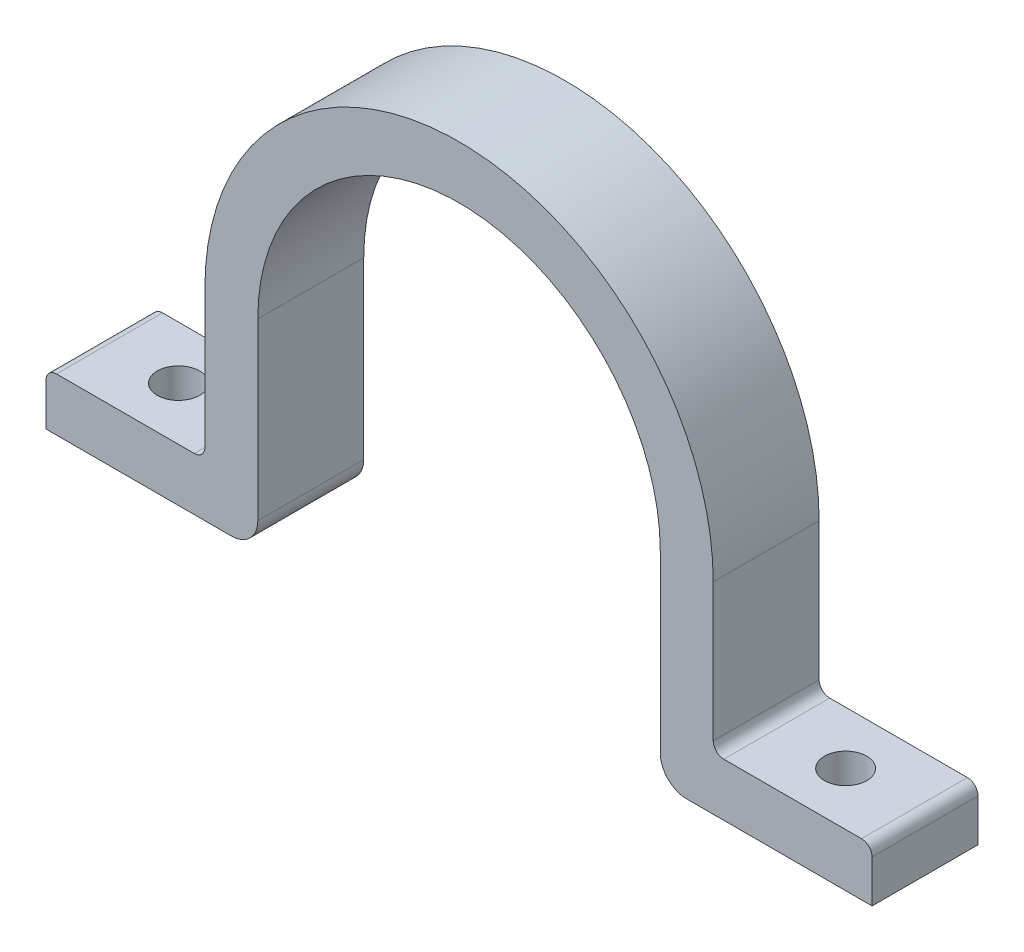
ISO-10303-21;
HEADER;
FILE_DESCRIPTION(('STEP AP214'),'2;1');
FILE_NAME('part.step','',(''),(''),'','','');
FILE_SCHEMA(('AUTOMOTIVE_DESIGN { 1 0 10303 214 1 1 1 1 }'));
ENDSEC;
DATA;
#1=APPLICATION_CONTEXT('core data for automotive mechanical design processes');
#2=APPLICATION_PROTOCOL_DEFINITION('international standard','automotive_design',2000,#1);
#3=PRODUCT_CONTEXT('',#1,'mechanical');
#4=PRODUCT('Part','Part','',(#3));
#5=PRODUCT_RELATED_PRODUCT_CATEGORY('part','',(#4));
#6=PRODUCT_DEFINITION_FORMATION('','',#4);
#7=PRODUCT_DEFINITION_CONTEXT('part definition',#1,'design');
#8=PRODUCT_DEFINITION('design','',#6,#7);
#9=PRODUCT_DEFINITION_SHAPE('','',#8);
#10=(LENGTH_UNIT() NAMED_UNIT(*) SI_UNIT(.MILLI.,.METRE.));
#11=(NAMED_UNIT(*) PLANE_ANGLE_UNIT() SI_UNIT($,.RADIAN.));
#12=(NAMED_UNIT(*) SI_UNIT($,.STERADIAN.) SOLID_ANGLE_UNIT());
#13=UNCERTAINTY_MEASURE_WITH_UNIT(LENGTH_MEASURE(1.E-05),#10,'distance_accuracy_value','');
#14=(GEOMETRIC_REPRESENTATION_CONTEXT(3) GLOBAL_UNCERTAINTY_ASSIGNED_CONTEXT((#13)) GLOBAL_UNIT_ASSIGNED_CONTEXT((#10,
#11,#12)) REPRESENTATION_CONTEXT('',''));
#15=CARTESIAN_POINT('',(0.,0.,0.));
#16=DIRECTION('',(0.,0.,1.));
#17=DIRECTION('',(1.,0.,0.));
#18=AXIS2_PLACEMENT_3D('',#15,#16,#17);
#19=CARTESIAN_POINT('',(-48.,0.,20.));
#20=DIRECTION('',(1.,0.,0.));
#21=DIRECTION('',(0.,0.,-1.));
#22=AXIS2_PLACEMENT_3D('',#19,#20,#21);
#23=PLANE('',#22);
#24=DIRECTION('',(0.,-1.,0.));
#25=VECTOR('',#24,1.);
#26=CARTESIAN_POINT('',(-48.,0.,0.));
#27=LINE('',#26,#25);
#28=CARTESIAN_POINT('',(-48.,0.,0.));
#29=VERTEX_POINT('',#28);
#30=CARTESIAN_POINT('',(-48.,-26.,0.));
#31=VERTEX_POINT('',#30);
#32=EDGE_CURVE('E211',#29,#31,#27,.T.);
#33=ORIENTED_EDGE('',*,*,#32,.T.);
#34=DIRECTION('',(0.,0.,-1.));
#35=VECTOR('',#34,1.);
#36=CARTESIAN_POINT('',(-48.,-26.,20.));
#37=LINE('',#36,#35);
#38=CARTESIAN_POINT('',(-48.,-26.,20.));
#39=VERTEX_POINT('',#38);
#40=EDGE_CURVE('E280',#31,#39,#37,.F.);
#41=ORIENTED_EDGE('',*,*,#40,.T.);
#42=DIRECTION('',(0.,-1.,0.));
#43=VECTOR('',#42,1.);
#44=CARTESIAN_POINT('',(-48.,0.,20.));
#45=LINE('',#44,#43);
#46=CARTESIAN_POINT('',(-48.,0.,20.));
#47=VERTEX_POINT('',#46);
#48=EDGE_CURVE('E240',#47,#39,#45,.T.);
#49=ORIENTED_EDGE('',*,*,#48,.F.);
#50=DIRECTION('',(0.,0.,-1.));
#51=VECTOR('',#50,1.);
#52=CARTESIAN_POINT('',(-48.,0.,20.));
#53=LINE('',#52,#51);
#54=EDGE_CURVE('E210',#47,#29,#53,.T.);
#55=ORIENTED_EDGE('',*,*,#54,.T.);
#56=EDGE_LOOP('',(#33,#41,#49,#55));
#57=FACE_BOUND('',#56,.T.);
#58=ADVANCED_FACE('F43',(#57),#23,.F.);
#59=CARTESIAN_POINT('',(-48.,-28.,20.));
#60=DIRECTION('',(0.,-1.,0.));
#61=DIRECTION('',(1.,0.,0.));
#62=AXIS2_PLACEMENT_3D('',#59,#60,#61);
#63=PLANE('',#62);
#64=CARTESIAN_POINT('',(-63.,-28.,10.));
#65=DIRECTION('',(0.,1.,0.));
#66=DIRECTION('',(-1.,0.,0.));
#67=AXIS2_PLACEMENT_3D('',#64,#65,#66);
#68=CIRCLE('',#67,4.00000000000001);
#69=CARTESIAN_POINT('',(-67.,-28.,10.));
#70=VERTEX_POINT('',#69);
#71=EDGE_CURVE('E377',#70,#70,#68,.T.);
#72=ORIENTED_EDGE('',*,*,#71,.F.);
#73=EDGE_LOOP('',(#72));
#74=FACE_BOUND('',#73,.T.);
#75=DIRECTION('',(-1.,0.,0.));
#76=VECTOR('',#75,1.);
#77=CARTESIAN_POINT('',(-48.,-28.,0.));
#78=LINE('',#77,#76);
#79=CARTESIAN_POINT('',(-50.,-28.,0.));
#80=VERTEX_POINT('',#79);
#81=CARTESIAN_POINT('',(-76.,-28.,0.));
#82=VERTEX_POINT('',#81);
#83=EDGE_CURVE('E214',#80,#82,#78,.T.);
#84=ORIENTED_EDGE('',*,*,#83,.T.);
#85=DIRECTION('',(0.,0.,-1.));
#86=VECTOR('',#85,1.);
#87=CARTESIAN_POINT('',(-76.,-28.,20.));
#88=LINE('',#87,#86);
#89=CARTESIAN_POINT('',(-76.,-28.,20.));
#90=VERTEX_POINT('',#89);
#91=EDGE_CURVE('E278',#82,#90,#88,.F.);
#92=ORIENTED_EDGE('',*,*,#91,.T.);
#93=DIRECTION('',(-1.,0.,0.));
#94=VECTOR('',#93,1.);
#95=CARTESIAN_POINT('',(-48.,-28.,20.));
#96=LINE('',#95,#94);
#97=CARTESIAN_POINT('',(-50.,-28.,20.));
#98=VERTEX_POINT('',#97);
#99=EDGE_CURVE('E177',#98,#90,#96,.T.);
#100=ORIENTED_EDGE('',*,*,#99,.F.);
#101=DIRECTION('',(0.,0.,-1.));
#102=VECTOR('',#101,1.);
#103=CARTESIAN_POINT('',(-50.,-28.,0.));
#104=LINE('',#103,#102);
#105=EDGE_CURVE('E275',#98,#80,#104,.T.);
#106=ORIENTED_EDGE('',*,*,#105,.T.);
#107=EDGE_LOOP('',(#84,#92,#100,#106));
#108=FACE_BOUND('',#107,.T.);
#109=ADVANCED_FACE('F369',(#74,#108),#63,.F.);
#110=CARTESIAN_POINT('',(-78.,-28.,20.));
#111=DIRECTION('',(1.,0.,0.));
#112=DIRECTION('',(0.,0.,-1.));
#113=AXIS2_PLACEMENT_3D('',#110,#111,#112);
#114=PLANE('',#113);
#115=DIRECTION('',(0.,-1.,0.));
#116=VECTOR('',#115,1.);
#117=CARTESIAN_POINT('',(-78.,-28.,20.));
#118=LINE('',#117,#116);
#119=CARTESIAN_POINT('',(-78.,-30.,20.));
#120=VERTEX_POINT('',#119);
#121=CARTESIAN_POINT('',(-78.,-38.,20.));
#122=VERTEX_POINT('',#121);
#123=EDGE_CURVE('E166',#120,#122,#118,.T.);
#124=ORIENTED_EDGE('',*,*,#123,.F.);
#125=DIRECTION('',(0.,0.,-1.));
#126=VECTOR('',#125,1.);
#127=CARTESIAN_POINT('',(-78.,-30.,20.));
#128=LINE('',#127,#126);
#129=CARTESIAN_POINT('',(-78.,-30.,0.));
#130=VERTEX_POINT('',#129);
#131=EDGE_CURVE('E273',#120,#130,#128,.T.);
#132=ORIENTED_EDGE('',*,*,#131,.T.);
#133=DIRECTION('',(0.,-1.,0.));
#134=VECTOR('',#133,1.);
#135=CARTESIAN_POINT('',(-78.,-28.,0.));
#136=LINE('',#135,#134);
#137=CARTESIAN_POINT('',(-78.,-38.,0.));
#138=VERTEX_POINT('',#137);
#139=EDGE_CURVE('E183',#130,#138,#136,.T.);
#140=ORIENTED_EDGE('',*,*,#139,.T.);
#141=DIRECTION('',(0.,0.,-1.));
#142=VECTOR('',#141,1.);
#143=CARTESIAN_POINT('',(-78.,-38.,20.));
#144=LINE('',#143,#142);
#145=EDGE_CURVE('E180',#122,#138,#144,.T.);
#146=ORIENTED_EDGE('',*,*,#145,.F.);
#147=EDGE_LOOP('',(#124,#132,#140,#146));
#148=FACE_BOUND('',#147,.T.);
#149=ADVANCED_FACE('F181',(#148),#114,.F.);
#150=CARTESIAN_POINT('',(-38.,-38.,20.));
#151=DIRECTION('',(0.,1.,0.));
#152=DIRECTION('',(0.,0.,1.));
#153=AXIS2_PLACEMENT_3D('',#150,#151,#152);
#154=PLANE('',#153);
#155=CARTESIAN_POINT('',(-63.,-38.,10.));
#156=DIRECTION('',(0.,1.,0.));
#157=DIRECTION('',(0.,0.,1.));
#158=AXIS2_PLACEMENT_3D('',#155,#156,#157);
#159=CIRCLE('',#158,4.00000000000001);
#160=CARTESIAN_POINT('',(-63.,-38.,14.));
#161=VERTEX_POINT('',#160);
#162=EDGE_CURVE('E215',#161,#161,#159,.T.);
#163=ORIENTED_EDGE('',*,*,#162,.T.);
#164=EDGE_LOOP('',(#163));
#165=FACE_BOUND('',#164,.T.);
#166=DIRECTION('',(1.,0.,0.));
#167=VECTOR('',#166,1.);
#168=CARTESIAN_POINT('',(-38.,-38.,0.));
#169=LINE('',#168,#167);
#170=CARTESIAN_POINT('',(-43.,-38.,0.));
#171=VERTEX_POINT('',#170);
#172=EDGE_CURVE('E219',#138,#171,#169,.T.);
#173=ORIENTED_EDGE('',*,*,#172,.T.);
#174=DIRECTION('',(0.,0.,-1.));
#175=VECTOR('',#174,1.);
#176=CARTESIAN_POINT('',(-43.,-38.,20.));
#177=LINE('',#176,#175);
#178=CARTESIAN_POINT('',(-43.,-38.,20.));
#179=VERTEX_POINT('',#178);
#180=EDGE_CURVE('E11',#171,#179,#177,.F.);
#181=ORIENTED_EDGE('',*,*,#180,.T.);
#182=DIRECTION('',(1.,0.,0.));
#183=VECTOR('',#182,1.);
#184=CARTESIAN_POINT('',(-38.,-38.,20.));
#185=LINE('',#184,#183);
#186=EDGE_CURVE('E170',#122,#179,#185,.T.);
#187=ORIENTED_EDGE('',*,*,#186,.F.);
#188=ORIENTED_EDGE('',*,*,#145,.T.);
#189=EDGE_LOOP('',(#173,#181,#187,#188));
#190=FACE_BOUND('',#189,.T.);
#191=ADVANCED_FACE('F188',(#165,#190),#154,.F.);
#192=CARTESIAN_POINT('',(-38.,0.,20.));
#193=DIRECTION('',(-1.,0.,0.));
#194=DIRECTION('',(0.,-1.,0.));
#195=AXIS2_PLACEMENT_3D('',#192,#193,#194);
#196=PLANE('',#195);
#197=DIRECTION('',(0.,1.,0.));
#198=VECTOR('',#197,1.);
#199=CARTESIAN_POINT('',(-38.,0.,20.));
#200=LINE('',#199,#198);
#201=CARTESIAN_POINT('',(-38.,-33.,20.));
#202=VERTEX_POINT('',#201);
#203=CARTESIAN_POINT('',(-38.,0.,20.));
#204=VERTEX_POINT('',#203);
#205=EDGE_CURVE('E189',#202,#204,#200,.T.);
#206=ORIENTED_EDGE('',*,*,#205,.F.);
#207=DIRECTION('',(0.,0.,-1.));
#208=VECTOR('',#207,1.);
#209=CARTESIAN_POINT('',(-38.,-33.,20.));
#210=LINE('',#209,#208);
#211=CARTESIAN_POINT('',(-38.,-33.,0.));
#212=VERTEX_POINT('',#211);
#213=EDGE_CURVE('E51',#202,#212,#210,.T.);
#214=ORIENTED_EDGE('',*,*,#213,.T.);
#215=DIRECTION('',(0.,1.,0.));
#216=VECTOR('',#215,1.);
#217=CARTESIAN_POINT('',(-38.,0.,0.));
#218=LINE('',#217,#216);
#219=CARTESIAN_POINT('',(-38.,0.,0.));
#220=VERTEX_POINT('',#219);
#221=EDGE_CURVE('E221',#212,#220,#218,.T.);
#222=ORIENTED_EDGE('',*,*,#221,.T.);
#223=DIRECTION('',(0.,0.,-1.));
#224=VECTOR('',#223,1.);
#225=CARTESIAN_POINT('',(-38.,0.,20.));
#226=LINE('',#225,#224);
#227=EDGE_CURVE('E186',#204,#220,#226,.T.);
#228=ORIENTED_EDGE('',*,*,#227,.F.);
#229=EDGE_LOOP('',(#206,#214,#222,#228));
#230=FACE_BOUND('',#229,.T.);
#231=ADVANCED_FACE('F305',(#230),#196,.F.);
#232=CARTESIAN_POINT('',(0.,0.,20.));
#233=DIRECTION('',(0.,0.,-1.));
#234=DIRECTION('',(-1.,0.,0.));
#235=AXIS2_PLACEMENT_3D('',#232,#233,#234);
#236=CYLINDRICAL_SURFACE('',#235,38.);
#237=CARTESIAN_POINT('',(0.,0.,0.));
#238=DIRECTION('',(0.,0.,-1.));
#239=DIRECTION('',(-1.,0.,0.));
#240=AXIS2_PLACEMENT_3D('',#237,#238,#239);
#241=CIRCLE('',#240,38.);
#242=CARTESIAN_POINT('',(38.,0.,0.));
#243=VERTEX_POINT('',#242);
#244=EDGE_CURVE('E223',#220,#243,#241,.T.);
#245=ORIENTED_EDGE('',*,*,#244,.T.);
#246=DIRECTION('',(0.,0.,-1.));
#247=VECTOR('',#246,1.);
#248=CARTESIAN_POINT('',(38.,0.,20.));
#249=LINE('',#248,#247);
#250=CARTESIAN_POINT('',(38.,0.,20.));
#251=VERTEX_POINT('',#250);
#252=EDGE_CURVE('E249',#251,#243,#249,.T.);
#253=ORIENTED_EDGE('',*,*,#252,.F.);
#254=CARTESIAN_POINT('',(0.,0.,20.));
#255=DIRECTION('',(0.,0.,-1.));
#256=DIRECTION('',(-1.,0.,0.));
#257=AXIS2_PLACEMENT_3D('',#254,#255,#256);
#258=CIRCLE('',#257,38.);
#259=EDGE_CURVE('E191',#204,#251,#258,.T.);
#260=ORIENTED_EDGE('',*,*,#259,.F.);
#261=ORIENTED_EDGE('',*,*,#227,.T.);
#262=EDGE_LOOP('',(#245,#253,#260,#261));
#263=FACE_BOUND('',#262,.T.);
#264=ADVANCED_FACE('F315',(#263),#236,.F.);
#265=CARTESIAN_POINT('',(38.,0.,20.));
#266=DIRECTION('',(1.,0.,0.));
#267=DIRECTION('',(0.,1.,0.));
#268=AXIS2_PLACEMENT_3D('',#265,#266,#267);
#269=PLANE('',#268);
#270=DIRECTION('',(0.,-1.,0.));
#271=VECTOR('',#270,1.);
#272=CARTESIAN_POINT('',(38.,0.,0.));
#273=LINE('',#272,#271);
#274=CARTESIAN_POINT('',(38.,-33.,0.));
#275=VERTEX_POINT('',#274);
#276=EDGE_CURVE('E225',#243,#275,#273,.T.);
#277=ORIENTED_EDGE('',*,*,#276,.T.);
#278=DIRECTION('',(0.,0.,-1.));
#279=VECTOR('',#278,1.);
#280=CARTESIAN_POINT('',(38.,-33.,20.));
#281=LINE('',#280,#279);
#282=CARTESIAN_POINT('',(38.,-33.,20.));
#283=VERTEX_POINT('',#282);
#284=EDGE_CURVE('E297',#275,#283,#281,.F.);
#285=ORIENTED_EDGE('',*,*,#284,.T.);
#286=DIRECTION('',(0.,-1.,0.));
#287=VECTOR('',#286,1.);
#288=CARTESIAN_POINT('',(38.,0.,20.));
#289=LINE('',#288,#287);
#290=EDGE_CURVE('E196',#251,#283,#289,.T.);
#291=ORIENTED_EDGE('',*,*,#290,.F.);
#292=ORIENTED_EDGE('',*,*,#252,.T.);
#293=EDGE_LOOP('',(#277,#285,#291,#292));
#294=FACE_BOUND('',#293,.T.);
#295=ADVANCED_FACE('F319',(#294),#269,.F.);
#296=CARTESIAN_POINT('',(38.,-38.,20.));
#297=DIRECTION('',(0.,1.,0.));
#298=DIRECTION('',(0.,0.,1.));
#299=AXIS2_PLACEMENT_3D('',#296,#297,#298);
#300=PLANE('',#299);
#301=CARTESIAN_POINT('',(63.,-38.,10.));
#302=DIRECTION('',(0.,1.,0.));
#303=DIRECTION('',(0.,0.,1.));
#304=AXIS2_PLACEMENT_3D('',#301,#302,#303);
#305=CIRCLE('',#304,4.00000000000001);
#306=CARTESIAN_POINT('',(63.,-38.,14.));
#307=VERTEX_POINT('',#306);
#308=EDGE_CURVE('E256',#307,#307,#305,.T.);
#309=ORIENTED_EDGE('',*,*,#308,.T.);
#310=EDGE_LOOP('',(#309));
#311=FACE_BOUND('',#310,.T.);
#312=DIRECTION('',(1.,0.,0.));
#313=VECTOR('',#312,1.);
#314=CARTESIAN_POINT('',(38.,-38.,20.));
#315=LINE('',#314,#313);
#316=CARTESIAN_POINT('',(43.,-38.,20.));
#317=VERTEX_POINT('',#316);
#318=CARTESIAN_POINT('',(78.,-38.,20.));
#319=VERTEX_POINT('',#318);
#320=EDGE_CURVE('E198',#317,#319,#315,.T.);
#321=ORIENTED_EDGE('',*,*,#320,.F.);
#322=DIRECTION('',(0.,0.,-1.));
#323=VECTOR('',#322,1.);
#324=CARTESIAN_POINT('',(43.,-38.,20.));
#325=LINE('',#324,#323);
#326=CARTESIAN_POINT('',(43.,-38.,0.));
#327=VERTEX_POINT('',#326);
#328=EDGE_CURVE('E290',#317,#327,#325,.T.);
#329=ORIENTED_EDGE('',*,*,#328,.T.);
#330=DIRECTION('',(1.,0.,0.));
#331=VECTOR('',#330,1.);
#332=CARTESIAN_POINT('',(38.,-38.,0.));
#333=LINE('',#332,#331);
#334=CARTESIAN_POINT('',(78.,-38.,0.));
#335=VERTEX_POINT('',#334);
#336=EDGE_CURVE('E228',#327,#335,#333,.T.);
#337=ORIENTED_EDGE('',*,*,#336,.T.);
#338=DIRECTION('',(0.,0.,-1.));
#339=VECTOR('',#338,1.);
#340=CARTESIAN_POINT('',(78.,-38.,20.));
#341=LINE('',#340,#339);
#342=EDGE_CURVE('E246',#319,#335,#341,.T.);
#343=ORIENTED_EDGE('',*,*,#342,.F.);
#344=EDGE_LOOP('',(#321,#329,#337,#343));
#345=FACE_BOUND('',#344,.T.);
#346=ADVANCED_FACE('F327',(#311,#345),#300,.F.);
#347=CARTESIAN_POINT('',(78.,-28.,20.));
#348=DIRECTION('',(-1.,0.,0.));
#349=DIRECTION('',(0.,0.,1.));
#350=AXIS2_PLACEMENT_3D('',#347,#348,#349);
#351=PLANE('',#350);
#352=DIRECTION('',(0.,1.,0.));
#353=VECTOR('',#352,1.);
#354=CARTESIAN_POINT('',(78.,-28.,0.));
#355=LINE('',#354,#353);
#356=CARTESIAN_POINT('',(78.,-30.,0.));
#357=VERTEX_POINT('',#356);
#358=EDGE_CURVE('E230',#335,#357,#355,.T.);
#359=ORIENTED_EDGE('',*,*,#358,.T.);
#360=DIRECTION('',(0.,0.,-1.));
#361=VECTOR('',#360,1.);
#362=CARTESIAN_POINT('',(78.,-30.,20.));
#363=LINE('',#362,#361);
#364=CARTESIAN_POINT('',(78.,-30.,20.));
#365=VERTEX_POINT('',#364);
#366=EDGE_CURVE('E265',#357,#365,#363,.F.);
#367=ORIENTED_EDGE('',*,*,#366,.T.);
#368=DIRECTION('',(0.,1.,0.));
#369=VECTOR('',#368,1.);
#370=CARTESIAN_POINT('',(78.,-28.,20.));
#371=LINE('',#370,#369);
#372=EDGE_CURVE('E200',#319,#365,#371,.T.);
#373=ORIENTED_EDGE('',*,*,#372,.F.);
#374=ORIENTED_EDGE('',*,*,#342,.T.);
#375=EDGE_LOOP('',(#359,#367,#373,#374));
#376=FACE_BOUND('',#375,.T.);
#377=ADVANCED_FACE('F333',(#376),#351,.F.);
#378=CARTESIAN_POINT('',(48.,-28.,20.));
#379=DIRECTION('',(0.,-1.,0.));
#380=DIRECTION('',(1.,0.,0.));
#381=AXIS2_PLACEMENT_3D('',#378,#379,#380);
#382=PLANE('',#381);
#383=CARTESIAN_POINT('',(63.,-28.,10.));
#384=DIRECTION('',(0.,1.,0.));
#385=DIRECTION('',(-1.,0.,0.));
#386=AXIS2_PLACEMENT_3D('',#383,#384,#385);
#387=CIRCLE('',#386,4.00000000000001);
#388=CARTESIAN_POINT('',(59.,-28.,10.));
#389=VERTEX_POINT('',#388);
#390=EDGE_CURVE('E378',#389,#389,#387,.T.);
#391=ORIENTED_EDGE('',*,*,#390,.F.);
#392=EDGE_LOOP('',(#391));
#393=FACE_BOUND('',#392,.T.);
#394=DIRECTION('',(-1.,0.,0.));
#395=VECTOR('',#394,1.);
#396=CARTESIAN_POINT('',(48.,-28.,20.));
#397=LINE('',#396,#395);
#398=CARTESIAN_POINT('',(76.,-28.,20.));
#399=VERTEX_POINT('',#398);
#400=CARTESIAN_POINT('',(50.,-28.,20.));
#401=VERTEX_POINT('',#400);
#402=EDGE_CURVE('E203',#399,#401,#397,.T.);
#403=ORIENTED_EDGE('',*,*,#402,.F.);
#404=DIRECTION('',(0.,0.,-1.));
#405=VECTOR('',#404,1.);
#406=CARTESIAN_POINT('',(76.,-28.,20.));
#407=LINE('',#406,#405);
#408=CARTESIAN_POINT('',(76.,-28.,0.));
#409=VERTEX_POINT('',#408);
#410=EDGE_CURVE('E258',#399,#409,#407,.T.);
#411=ORIENTED_EDGE('',*,*,#410,.T.);
#412=DIRECTION('',(-1.,0.,0.));
#413=VECTOR('',#412,1.);
#414=CARTESIAN_POINT('',(48.,-28.,0.));
#415=LINE('',#414,#413);
#416=CARTESIAN_POINT('',(50.,-28.,0.));
#417=VERTEX_POINT('',#416);
#418=EDGE_CURVE('E233',#409,#417,#415,.T.);
#419=ORIENTED_EDGE('',*,*,#418,.T.);
#420=DIRECTION('',(0.,0.,-1.));
#421=VECTOR('',#420,1.);
#422=CARTESIAN_POINT('',(50.,-28.,20.));
#423=LINE('',#422,#421);
#424=EDGE_CURVE('E185',#417,#401,#423,.F.);
#425=ORIENTED_EDGE('',*,*,#424,.T.);
#426=EDGE_LOOP('',(#403,#411,#419,#425));
#427=FACE_BOUND('',#426,.T.);
#428=ADVANCED_FACE('F342',(#393,#427),#382,.F.);
#429=CARTESIAN_POINT('',(48.,0.,20.));
#430=DIRECTION('',(-1.,0.,0.));
#431=DIRECTION('',(0.,-1.,0.));
#432=AXIS2_PLACEMENT_3D('',#429,#430,#431);
#433=PLANE('',#432);
#434=DIRECTION('',(0.,1.,0.));
#435=VECTOR('',#434,1.);
#436=CARTESIAN_POINT('',(48.,0.,20.));
#437=LINE('',#436,#435);
#438=CARTESIAN_POINT('',(48.,-26.,20.));
#439=VERTEX_POINT('',#438);
#440=CARTESIAN_POINT('',(48.,0.,20.));
#441=VERTEX_POINT('',#440);
#442=EDGE_CURVE('E206',#439,#441,#437,.T.);
#443=ORIENTED_EDGE('',*,*,#442,.F.);
#444=DIRECTION('',(0.,0.,-1.));
#445=VECTOR('',#444,1.);
#446=CARTESIAN_POINT('',(48.,-26.,0.));
#447=LINE('',#446,#445);
#448=CARTESIAN_POINT('',(48.,-26.,0.));
#449=VERTEX_POINT('',#448);
#450=EDGE_CURVE('E270',#439,#449,#447,.T.);
#451=ORIENTED_EDGE('',*,*,#450,.T.);
#452=DIRECTION('',(0.,1.,0.));
#453=VECTOR('',#452,1.);
#454=CARTESIAN_POINT('',(48.,0.,0.));
#455=LINE('',#454,#453);
#456=CARTESIAN_POINT('',(48.,0.,0.));
#457=VERTEX_POINT('',#456);
#458=EDGE_CURVE('E236',#449,#457,#455,.T.);
#459=ORIENTED_EDGE('',*,*,#458,.T.);
#460=DIRECTION('',(0.,0.,-1.));
#461=VECTOR('',#460,1.);
#462=CARTESIAN_POINT('',(48.,0.,20.));
#463=LINE('',#462,#461);
#464=EDGE_CURVE('E243',#441,#457,#463,.T.);
#465=ORIENTED_EDGE('',*,*,#464,.F.);
#466=EDGE_LOOP('',(#443,#451,#459,#465));
#467=FACE_BOUND('',#466,.T.);
#468=ADVANCED_FACE('F350',(#467),#433,.F.);
#469=CARTESIAN_POINT('',(0.,0.,20.));
#470=DIRECTION('',(0.,0.,-1.));
#471=DIRECTION('',(-1.,0.,0.));
#472=AXIS2_PLACEMENT_3D('',#469,#470,#471);
#473=CYLINDRICAL_SURFACE('',#472,48.);
#474=CARTESIAN_POINT('',(0.,0.,0.));
#475=DIRECTION('',(0.,0.,1.));
#476=DIRECTION('',(-1.,0.,0.));
#477=AXIS2_PLACEMENT_3D('',#474,#475,#476);
#478=CIRCLE('',#477,48.);
#479=EDGE_CURVE('E238',#457,#29,#478,.T.);
#480=ORIENTED_EDGE('',*,*,#479,.T.);
#481=ORIENTED_EDGE('',*,*,#54,.F.);
#482=CARTESIAN_POINT('',(0.,0.,20.));
#483=DIRECTION('',(0.,0.,1.));
#484=DIRECTION('',(-1.,0.,0.));
#485=AXIS2_PLACEMENT_3D('',#482,#483,#484);
#486=CIRCLE('',#485,48.);
#487=EDGE_CURVE('E208',#441,#47,#486,.T.);
#488=ORIENTED_EDGE('',*,*,#487,.F.);
#489=ORIENTED_EDGE('',*,*,#464,.T.);
#490=EDGE_LOOP('',(#480,#481,#488,#489));
#491=FACE_BOUND('',#490,.T.);
#492=ADVANCED_FACE('F356',(#491),#473,.T.);
#493=CARTESIAN_POINT('',(0.,0.,20.));
#494=DIRECTION('',(0.,0.,-1.));
#495=DIRECTION('',(-1.,0.,0.));
#496=AXIS2_PLACEMENT_3D('',#493,#494,#495);
#497=PLANE('',#496);
#498=ORIENTED_EDGE('',*,*,#290,.T.);
#499=CARTESIAN_POINT('',(43.,-33.,20.));
#500=DIRECTION('',(0.,0.,-1.));
#501=DIRECTION('',(-1.,0.,0.));
#502=AXIS2_PLACEMENT_3D('',#499,#500,#501);
#503=CIRCLE('',#502,5.);
#504=EDGE_CURVE('E300',#283,#317,#503,.F.);
#505=ORIENTED_EDGE('',*,*,#504,.T.);
#506=ORIENTED_EDGE('',*,*,#320,.T.);
#507=ORIENTED_EDGE('',*,*,#372,.T.);
#508=CARTESIAN_POINT('',(76.,-30.,20.));
#509=DIRECTION('',(0.,0.,-1.));
#510=DIRECTION('',(-1.,0.,0.));
#511=AXIS2_PLACEMENT_3D('',#508,#509,#510);
#512=CIRCLE('',#511,2.);
#513=EDGE_CURVE('E268',#365,#399,#512,.F.);
#514=ORIENTED_EDGE('',*,*,#513,.T.);
#515=ORIENTED_EDGE('',*,*,#402,.T.);
#516=CARTESIAN_POINT('',(50.,-26.,20.));
#517=DIRECTION('',(0.,0.,-1.));
#518=DIRECTION('',(-1.,0.,0.));
#519=AXIS2_PLACEMENT_3D('',#516,#517,#518);
#520=CIRCLE('',#519,2.);
#521=EDGE_CURVE('E284',#401,#439,#520,.T.);
#522=ORIENTED_EDGE('',*,*,#521,.T.);
#523=ORIENTED_EDGE('',*,*,#442,.T.);
#524=ORIENTED_EDGE('',*,*,#487,.T.);
#525=ORIENTED_EDGE('',*,*,#48,.T.);
#526=CARTESIAN_POINT('',(-50.,-26.,20.));
#527=DIRECTION('',(0.,0.,-1.));
#528=DIRECTION('',(-1.,0.,0.));
#529=AXIS2_PLACEMENT_3D('',#526,#527,#528);
#530=CIRCLE('',#529,2.);
#531=EDGE_CURVE('E288',#39,#98,#530,.T.);
#532=ORIENTED_EDGE('',*,*,#531,.T.);
#533=ORIENTED_EDGE('',*,*,#99,.T.);
#534=CARTESIAN_POINT('',(-76.,-30.,20.));
#535=DIRECTION('',(0.,0.,-1.));
#536=DIRECTION('',(-1.,0.,0.));
#537=AXIS2_PLACEMENT_3D('',#534,#535,#536);
#538=CIRCLE('',#537,2.);
#539=EDGE_CURVE('E173',#90,#120,#538,.F.);
#540=ORIENTED_EDGE('',*,*,#539,.T.);
#541=ORIENTED_EDGE('',*,*,#123,.T.);
#542=ORIENTED_EDGE('',*,*,#186,.T.);
#543=CARTESIAN_POINT('',(-43.,-33.,20.));
#544=DIRECTION('',(0.,0.,-1.));
#545=DIRECTION('',(-1.,0.,0.));
#546=AXIS2_PLACEMENT_3D('',#543,#544,#545);
#547=CIRCLE('',#546,5.);
#548=EDGE_CURVE('E58',#179,#202,#547,.F.);
#549=ORIENTED_EDGE('',*,*,#548,.T.);
#550=ORIENTED_EDGE('',*,*,#205,.T.);
#551=ORIENTED_EDGE('',*,*,#259,.T.);
#552=EDGE_LOOP('',(#498,#505,#506,#507,#514,#515,#522,#523,#524,#525,#532,#533,#540,#541,#542,
#549,#550,#551));
#553=FACE_BOUND('',#552,.T.);
#554=ADVANCED_FACE('F169',(#553),#497,.F.);
#555=CARTESIAN_POINT('',(0.,0.,0.));
#556=DIRECTION('',(0.,0.,-1.));
#557=DIRECTION('',(-1.,0.,0.));
#558=AXIS2_PLACEMENT_3D('',#555,#556,#557);
#559=PLANE('',#558);
#560=ORIENTED_EDGE('',*,*,#336,.F.);
#561=CARTESIAN_POINT('',(43.,-33.,0.));
#562=DIRECTION('',(0.,0.,-1.));
#563=DIRECTION('',(-1.,0.,0.));
#564=AXIS2_PLACEMENT_3D('',#561,#562,#563);
#565=CIRCLE('',#564,5.);
#566=EDGE_CURVE('E295',#327,#275,#565,.T.);
#567=ORIENTED_EDGE('',*,*,#566,.T.);
#568=ORIENTED_EDGE('',*,*,#276,.F.);
#569=ORIENTED_EDGE('',*,*,#244,.F.);
#570=ORIENTED_EDGE('',*,*,#221,.F.);
#571=CARTESIAN_POINT('',(-43.,-33.,0.));
#572=DIRECTION('',(0.,0.,-1.));
#573=DIRECTION('',(-1.,0.,0.));
#574=AXIS2_PLACEMENT_3D('',#571,#572,#573);
#575=CIRCLE('',#574,5.);
#576=EDGE_CURVE('E293',#212,#171,#575,.T.);
#577=ORIENTED_EDGE('',*,*,#576,.T.);
#578=ORIENTED_EDGE('',*,*,#172,.F.);
#579=ORIENTED_EDGE('',*,*,#139,.F.);
#580=CARTESIAN_POINT('',(-76.,-30.,0.));
#581=DIRECTION('',(0.,0.,-1.));
#582=DIRECTION('',(-1.,0.,0.));
#583=AXIS2_PLACEMENT_3D('',#580,#581,#582);
#584=CIRCLE('',#583,2.);
#585=EDGE_CURVE('E261',#130,#82,#584,.T.);
#586=ORIENTED_EDGE('',*,*,#585,.T.);
#587=ORIENTED_EDGE('',*,*,#83,.F.);
#588=CARTESIAN_POINT('',(-50.,-26.,0.));
#589=DIRECTION('',(0.,0.,-1.));
#590=DIRECTION('',(-1.,0.,0.));
#591=AXIS2_PLACEMENT_3D('',#588,#589,#590);
#592=CIRCLE('',#591,2.);
#593=EDGE_CURVE('E286',#80,#31,#592,.F.);
#594=ORIENTED_EDGE('',*,*,#593,.T.);
#595=ORIENTED_EDGE('',*,*,#32,.F.);
#596=ORIENTED_EDGE('',*,*,#479,.F.);
#597=ORIENTED_EDGE('',*,*,#458,.F.);
#598=CARTESIAN_POINT('',(50.,-26.,0.));
#599=DIRECTION('',(0.,0.,-1.));
#600=DIRECTION('',(-1.,0.,0.));
#601=AXIS2_PLACEMENT_3D('',#598,#599,#600);
#602=CIRCLE('',#601,2.);
#603=EDGE_CURVE('E282',#449,#417,#602,.F.);
#604=ORIENTED_EDGE('',*,*,#603,.T.);
#605=ORIENTED_EDGE('',*,*,#418,.F.);
#606=CARTESIAN_POINT('',(76.,-30.,0.));
#607=DIRECTION('',(0.,0.,-1.));
#608=DIRECTION('',(-1.,0.,0.));
#609=AXIS2_PLACEMENT_3D('',#606,#607,#608);
#610=CIRCLE('',#609,2.);
#611=EDGE_CURVE('E263',#409,#357,#610,.T.);
#612=ORIENTED_EDGE('',*,*,#611,.T.);
#613=ORIENTED_EDGE('',*,*,#358,.F.);
#614=EDGE_LOOP('',(#560,#567,#568,#569,#570,#577,#578,#579,#586,#587,#594,#595,#596,#597,#604,
#605,#612,#613));
#615=FACE_BOUND('',#614,.T.);
#616=ADVANCED_FACE('F311',(#615),#559,.T.);
#617=CARTESIAN_POINT('',(63.,-48.,10.));
#618=DIRECTION('',(0.,1.,0.));
#619=DIRECTION('',(-1.,0.,0.));
#620=AXIS2_PLACEMENT_3D('',#617,#618,#619);
#621=CYLINDRICAL_SURFACE('',#620,4.00000000000001);
#622=ORIENTED_EDGE('',*,*,#390,.T.);
#623=EDGE_LOOP('',(#622));
#624=FACE_BOUND('',#623,.T.);
#625=ORIENTED_EDGE('',*,*,#308,.F.);
#626=EDGE_LOOP('',(#625));
#627=FACE_BOUND('',#626,.T.);
#628=ADVANCED_FACE('F451',(#624,#627),#621,.F.);
#629=CARTESIAN_POINT('',(-63.,-48.,10.));
#630=DIRECTION('',(0.,1.,0.));
#631=DIRECTION('',(-1.,0.,0.));
#632=AXIS2_PLACEMENT_3D('',#629,#630,#631);
#633=CYLINDRICAL_SURFACE('',#632,4.00000000000001);
#634=ORIENTED_EDGE('',*,*,#71,.T.);
#635=EDGE_LOOP('',(#634));
#636=FACE_BOUND('',#635,.T.);
#637=ORIENTED_EDGE('',*,*,#162,.F.);
#638=EDGE_LOOP('',(#637));
#639=FACE_BOUND('',#638,.T.);
#640=ADVANCED_FACE('F384',(#636,#639),#633,.F.);
#641=CARTESIAN_POINT('',(76.,-30.,20.));
#642=DIRECTION('',(0.,0.,-1.));
#643=DIRECTION('',(-1.,0.,0.));
#644=AXIS2_PLACEMENT_3D('',#641,#642,#643);
#645=CYLINDRICAL_SURFACE('',#644,2.);
#646=ORIENTED_EDGE('',*,*,#513,.F.);
#647=ORIENTED_EDGE('',*,*,#366,.F.);
#648=ORIENTED_EDGE('',*,*,#611,.F.);
#649=ORIENTED_EDGE('',*,*,#410,.F.);
#650=EDGE_LOOP('',(#646,#647,#648,#649));
#651=FACE_BOUND('',#650,.T.);
#652=ADVANCED_FACE('F337',(#651),#645,.T.);
#653=CARTESIAN_POINT('',(50.,-26.,20.));
#654=DIRECTION('',(0.,0.,1.));
#655=DIRECTION('',(1.,0.,0.));
#656=AXIS2_PLACEMENT_3D('',#653,#654,#655);
#657=CYLINDRICAL_SURFACE('',#656,2.);
#658=ORIENTED_EDGE('',*,*,#521,.F.);
#659=ORIENTED_EDGE('',*,*,#424,.F.);
#660=ORIENTED_EDGE('',*,*,#603,.F.);
#661=ORIENTED_EDGE('',*,*,#450,.F.);
#662=EDGE_LOOP('',(#658,#659,#660,#661));
#663=FACE_BOUND('',#662,.T.);
#664=ADVANCED_FACE('F345',(#663),#657,.F.);
#665=CARTESIAN_POINT('',(-76.,-30.,20.));
#666=DIRECTION('',(0.,0.,-1.));
#667=DIRECTION('',(-1.,0.,0.));
#668=AXIS2_PLACEMENT_3D('',#665,#666,#667);
#669=CYLINDRICAL_SURFACE('',#668,2.);
#670=ORIENTED_EDGE('',*,*,#539,.F.);
#671=ORIENTED_EDGE('',*,*,#91,.F.);
#672=ORIENTED_EDGE('',*,*,#585,.F.);
#673=ORIENTED_EDGE('',*,*,#131,.F.);
#674=EDGE_LOOP('',(#670,#671,#672,#673));
#675=FACE_BOUND('',#674,.T.);
#676=ADVANCED_FACE('F373',(#675),#669,.T.);
#677=CARTESIAN_POINT('',(-50.,-26.,20.));
#678=DIRECTION('',(0.,0.,1.));
#679=DIRECTION('',(1.,0.,0.));
#680=AXIS2_PLACEMENT_3D('',#677,#678,#679);
#681=CYLINDRICAL_SURFACE('',#680,2.);
#682=ORIENTED_EDGE('',*,*,#531,.F.);
#683=ORIENTED_EDGE('',*,*,#40,.F.);
#684=ORIENTED_EDGE('',*,*,#593,.F.);
#685=ORIENTED_EDGE('',*,*,#105,.F.);
#686=EDGE_LOOP('',(#682,#683,#684,#685));
#687=FACE_BOUND('',#686,.T.);
#688=ADVANCED_FACE('F366',(#687),#681,.F.);
#689=CARTESIAN_POINT('',(43.,-33.,20.));
#690=DIRECTION('',(0.,0.,-1.));
#691=DIRECTION('',(-1.,0.,0.));
#692=AXIS2_PLACEMENT_3D('',#689,#690,#691);
#693=CYLINDRICAL_SURFACE('',#692,5.);
#694=ORIENTED_EDGE('',*,*,#504,.F.);
#695=ORIENTED_EDGE('',*,*,#284,.F.);
#696=ORIENTED_EDGE('',*,*,#566,.F.);
#697=ORIENTED_EDGE('',*,*,#328,.F.);
#698=EDGE_LOOP('',(#694,#695,#696,#697));
#699=FACE_BOUND('',#698,.T.);
#700=ADVANCED_FACE('F325',(#699),#693,.T.);
#701=CARTESIAN_POINT('',(-43.,-33.,20.));
#702=DIRECTION('',(0.,0.,-1.));
#703=DIRECTION('',(-1.,0.,0.));
#704=AXIS2_PLACEMENT_3D('',#701,#702,#703);
#705=CYLINDRICAL_SURFACE('',#704,5.);
#706=ORIENTED_EDGE('',*,*,#548,.F.);
#707=ORIENTED_EDGE('',*,*,#180,.F.);
#708=ORIENTED_EDGE('',*,*,#576,.F.);
#709=ORIENTED_EDGE('',*,*,#213,.F.);
#710=EDGE_LOOP('',(#706,#707,#708,#709));
#711=FACE_BOUND('',#710,.T.);
#712=ADVANCED_FACE('F45',(#711),#705,.T.);
#713=CLOSED_SHELL('',(#58,#109,#149,#191,#231,#264,#295,#346,#377,#428,#468,#492,#554,#616,#628,
#640,#652,#664,#676,#688,#700,#712));
#714=MANIFOLD_SOLID_BREP('B2',#713);
#715=ADVANCED_BREP_SHAPE_REPRESENTATION('',(#18,#714),#14);
#716=SHAPE_DEFINITION_REPRESENTATION(#9,#715);
ENDSEC;
END-ISO-10303-21;
